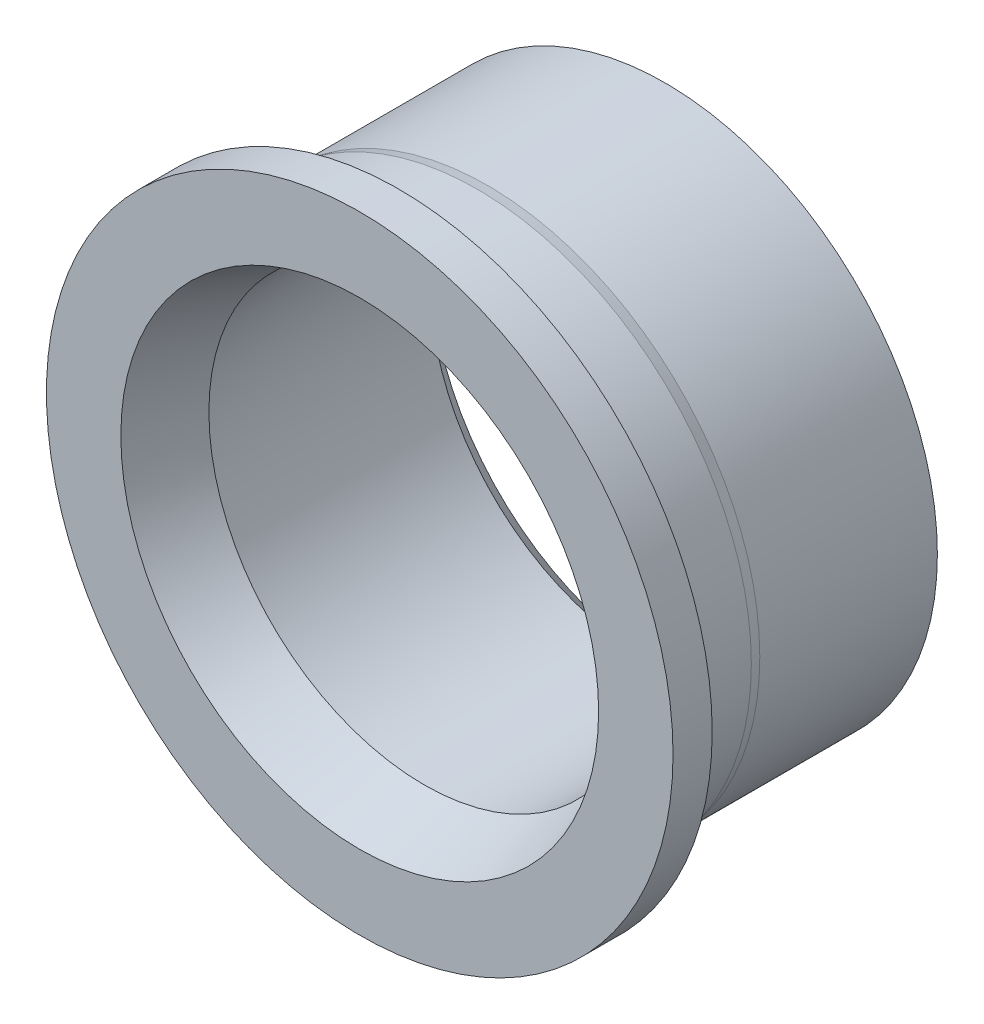
ISO-10303-21;
HEADER;
FILE_DESCRIPTION(('STEP AP214'),'2;1');
FILE_NAME('part.step','',(''),(''),'','','');
FILE_SCHEMA(('AUTOMOTIVE_DESIGN { 1 0 10303 214 1 1 1 1 }'));
ENDSEC;
DATA;
#1=APPLICATION_CONTEXT('core data for automotive mechanical design processes');
#2=APPLICATION_PROTOCOL_DEFINITION('international standard','automotive_design',2000,#1);
#3=PRODUCT_CONTEXT('',#1,'mechanical');
#4=PRODUCT('Part','Part','',(#3));
#5=PRODUCT_RELATED_PRODUCT_CATEGORY('part','',(#4));
#6=PRODUCT_DEFINITION_FORMATION('','',#4);
#7=PRODUCT_DEFINITION_CONTEXT('part definition',#1,'design');
#8=PRODUCT_DEFINITION('design','',#6,#7);
#9=PRODUCT_DEFINITION_SHAPE('','',#8);
#10=(LENGTH_UNIT() NAMED_UNIT(*) SI_UNIT(.MILLI.,.METRE.));
#11=(NAMED_UNIT(*) PLANE_ANGLE_UNIT() SI_UNIT($,.RADIAN.));
#12=(NAMED_UNIT(*) SI_UNIT($,.STERADIAN.) SOLID_ANGLE_UNIT());
#13=UNCERTAINTY_MEASURE_WITH_UNIT(LENGTH_MEASURE(1.E-05),#10,'distance_accuracy_value','');
#14=(GEOMETRIC_REPRESENTATION_CONTEXT(3) GLOBAL_UNCERTAINTY_ASSIGNED_CONTEXT((#13)) GLOBAL_UNIT_ASSIGNED_CONTEXT((#10,
#11,#12)) REPRESENTATION_CONTEXT('',''));
#15=CARTESIAN_POINT('',(0.,0.,0.));
#16=DIRECTION('',(0.,0.,1.));
#17=DIRECTION('',(1.,0.,0.));
#18=AXIS2_PLACEMENT_3D('',#15,#16,#17);
#19=CARTESIAN_POINT('',(0.,8.,0.));
#20=DIRECTION('',(0.,0.,-1.));
#21=DIRECTION('',(-1.,0.,0.));
#22=AXIS2_PLACEMENT_3D('',#19,#20,#21);
#23=PLANE('',#22);
#24=CARTESIAN_POINT('',(0.,0.,0.));
#25=DIRECTION('',(0.,0.,-1.));
#26=DIRECTION('',(-1.,0.,0.));
#27=AXIS2_PLACEMENT_3D('',#24,#25,#26);
#28=CIRCLE('',#27,6.1);
#29=CARTESIAN_POINT('',(-6.1,0.,0.));
#30=VERTEX_POINT('',#29);
#31=EDGE_CURVE('E12',#30,#30,#28,.T.);
#32=ORIENTED_EDGE('',*,*,#31,.T.);
#33=EDGE_LOOP('',(#32));
#34=FACE_BOUND('',#33,.T.);
#35=CARTESIAN_POINT('',(0.,0.,0.));
#36=DIRECTION('',(0.,0.,1.));
#37=DIRECTION('',(1.,0.,0.));
#38=AXIS2_PLACEMENT_3D('',#35,#36,#37);
#39=CIRCLE('',#38,8.);
#40=CARTESIAN_POINT('',(8.,0.,0.));
#41=VERTEX_POINT('',#40);
#42=EDGE_CURVE('E76',#41,#41,#39,.T.);
#43=ORIENTED_EDGE('',*,*,#42,.T.);
#44=EDGE_LOOP('',(#43));
#45=FACE_BOUND('',#44,.T.);
#46=ADVANCED_FACE('F41',(#34,#45),#23,.F.);
#47=CARTESIAN_POINT('',(0.,0.,0.));
#48=DIRECTION('',(0.,0.,1.));
#49=DIRECTION('',(1.,0.,0.));
#50=AXIS2_PLACEMENT_3D('',#47,#48,#49);
#51=CYLINDRICAL_SURFACE('',#50,5.5);
#52=CARTESIAN_POINT('',(0.,0.,-1.64848645167276));
#53=DIRECTION('',(0.,0.,-1.));
#54=DIRECTION('',(-1.,0.,0.));
#55=AXIS2_PLACEMENT_3D('',#52,#53,#54);
#56=CIRCLE('',#55,5.5);
#57=CARTESIAN_POINT('',(-5.5,0.,-1.64848645167276));
#58=VERTEX_POINT('',#57);
#59=EDGE_CURVE('E48',#58,#58,#56,.F.);
#60=ORIENTED_EDGE('',*,*,#59,.T.);
#61=EDGE_LOOP('',(#60));
#62=FACE_BOUND('',#61,.T.);
#63=CARTESIAN_POINT('',(0.,0.,-7.3));
#64=DIRECTION('',(0.,0.,1.));
#65=DIRECTION('',(1.,0.,0.));
#66=AXIS2_PLACEMENT_3D('',#63,#64,#65);
#67=CIRCLE('',#66,5.5);
#68=CARTESIAN_POINT('',(5.5,0.,-7.3));
#69=VERTEX_POINT('',#68);
#70=EDGE_CURVE('E52',#69,#69,#67,.F.);
#71=ORIENTED_EDGE('',*,*,#70,.T.);
#72=EDGE_LOOP('',(#71));
#73=FACE_BOUND('',#72,.T.);
#74=ADVANCED_FACE('F114',(#62,#73),#51,.F.);
#75=CARTESIAN_POINT('',(0.,5.5,-7.8));
#76=DIRECTION('',(0.,0.,1.));
#77=DIRECTION('',(1.,0.,0.));
#78=AXIS2_PLACEMENT_3D('',#75,#76,#77);
#79=PLANE('',#78);
#80=CARTESIAN_POINT('',(0.,0.,-7.8));
#81=DIRECTION('',(0.,0.,1.));
#82=DIRECTION('',(1.,0.,0.));
#83=AXIS2_PLACEMENT_3D('',#80,#81,#82);
#84=CIRCLE('',#83,6.);
#85=CARTESIAN_POINT('',(6.,0.,-7.8));
#86=VERTEX_POINT('',#85);
#87=EDGE_CURVE('E56',#86,#86,#84,.T.);
#88=ORIENTED_EDGE('',*,*,#87,.T.);
#89=EDGE_LOOP('',(#88));
#90=FACE_BOUND('',#89,.T.);
#91=CARTESIAN_POINT('',(0.,0.,-7.8));
#92=DIRECTION('',(0.,0.,1.));
#93=DIRECTION('',(1.,0.,0.));
#94=AXIS2_PLACEMENT_3D('',#91,#92,#93);
#95=CIRCLE('',#94,6.95);
#96=CARTESIAN_POINT('',(6.95,0.,-7.8));
#97=VERTEX_POINT('',#96);
#98=EDGE_CURVE('E61',#97,#97,#95,.T.);
#99=ORIENTED_EDGE('',*,*,#98,.F.);
#100=EDGE_LOOP('',(#99));
#101=FACE_BOUND('',#100,.T.);
#102=ADVANCED_FACE('F109',(#90,#101),#79,.F.);
#103=CARTESIAN_POINT('',(0.,0.,0.));
#104=DIRECTION('',(0.,0.,1.));
#105=DIRECTION('',(1.,0.,0.));
#106=AXIS2_PLACEMENT_3D('',#103,#104,#105);
#107=CYLINDRICAL_SURFACE('',#106,6.95);
#108=CARTESIAN_POINT('',(0.,0.,-3.2655745069445));
#109=DIRECTION('',(0.,0.,1.));
#110=DIRECTION('',(1.,0.,0.));
#111=AXIS2_PLACEMENT_3D('',#108,#109,#110);
#112=CIRCLE('',#111,6.95);
#113=CARTESIAN_POINT('',(6.95,0.,-3.2655745069445));
#114=VERTEX_POINT('',#113);
#115=EDGE_CURVE('E64',#114,#114,#112,.T.);
#116=ORIENTED_EDGE('',*,*,#115,.F.);
#117=EDGE_LOOP('',(#116));
#118=FACE_BOUND('',#117,.T.);
#119=ORIENTED_EDGE('',*,*,#98,.T.);
#120=EDGE_LOOP('',(#119));
#121=FACE_BOUND('',#120,.T.);
#122=ADVANCED_FACE('F103',(#118,#121),#107,.T.);
#123=CARTESIAN_POINT('',(0.,0.,-3.2655745069445));
#124=DIRECTION('',(0.,0.,1.));
#125=DIRECTION('',(1.,0.,0.));
#126=AXIS2_PLACEMENT_3D('',#123,#124,#125);
#127=CONICAL_SURFACE('',#126,6.95,0.186092740965923);
#128=CARTESIAN_POINT('',(0.,0.,-3.));
#129=DIRECTION('',(0.,0.,1.));
#130=DIRECTION('',(1.,0.,0.));
#131=AXIS2_PLACEMENT_3D('',#128,#129,#130);
#132=CIRCLE('',#131,7.);
#133=CARTESIAN_POINT('',(7.,0.,-3.));
#134=VERTEX_POINT('',#133);
#135=EDGE_CURVE('E67',#134,#134,#132,.T.);
#136=ORIENTED_EDGE('',*,*,#135,.F.);
#137=EDGE_LOOP('',(#136));
#138=FACE_BOUND('',#137,.T.);
#139=ORIENTED_EDGE('',*,*,#115,.T.);
#140=EDGE_LOOP('',(#139));
#141=FACE_BOUND('',#140,.T.);
#142=ADVANCED_FACE('F97',(#138,#141),#127,.T.);
#143=CARTESIAN_POINT('',(0.,0.,0.));
#144=DIRECTION('',(0.,0.,1.));
#145=DIRECTION('',(1.,0.,0.));
#146=AXIS2_PLACEMENT_3D('',#143,#144,#145);
#147=CYLINDRICAL_SURFACE('',#146,7.);
#148=CARTESIAN_POINT('',(0.,0.,-1.));
#149=DIRECTION('',(0.,0.,1.));
#150=DIRECTION('',(1.,0.,0.));
#151=AXIS2_PLACEMENT_3D('',#148,#149,#150);
#152=CIRCLE('',#151,7.);
#153=CARTESIAN_POINT('',(7.,0.,-1.));
#154=VERTEX_POINT('',#153);
#155=EDGE_CURVE('E70',#154,#154,#152,.T.);
#156=ORIENTED_EDGE('',*,*,#155,.F.);
#157=EDGE_LOOP('',(#156));
#158=FACE_BOUND('',#157,.T.);
#159=ORIENTED_EDGE('',*,*,#135,.T.);
#160=EDGE_LOOP('',(#159));
#161=FACE_BOUND('',#160,.T.);
#162=ADVANCED_FACE('F91',(#158,#161),#147,.T.);
#163=CARTESIAN_POINT('',(0.,7.,-1.));
#164=DIRECTION('',(0.,0.,1.));
#165=DIRECTION('',(1.,0.,0.));
#166=AXIS2_PLACEMENT_3D('',#163,#164,#165);
#167=PLANE('',#166);
#168=CARTESIAN_POINT('',(0.,0.,-1.));
#169=DIRECTION('',(0.,0.,1.));
#170=DIRECTION('',(1.,0.,0.));
#171=AXIS2_PLACEMENT_3D('',#168,#169,#170);
#172=CIRCLE('',#171,8.);
#173=CARTESIAN_POINT('',(8.,0.,-1.));
#174=VERTEX_POINT('',#173);
#175=EDGE_CURVE('E73',#174,#174,#172,.T.);
#176=ORIENTED_EDGE('',*,*,#175,.F.);
#177=EDGE_LOOP('',(#176));
#178=FACE_BOUND('',#177,.T.);
#179=ORIENTED_EDGE('',*,*,#155,.T.);
#180=EDGE_LOOP('',(#179));
#181=FACE_BOUND('',#180,.T.);
#182=ADVANCED_FACE('F85',(#178,#181),#167,.F.);
#183=CARTESIAN_POINT('',(0.,0.,0.));
#184=DIRECTION('',(0.,0.,1.));
#185=DIRECTION('',(1.,0.,0.));
#186=AXIS2_PLACEMENT_3D('',#183,#184,#185);
#187=CYLINDRICAL_SURFACE('',#186,8.);
#188=ORIENTED_EDGE('',*,*,#42,.F.);
#189=EDGE_LOOP('',(#188));
#190=FACE_BOUND('',#189,.T.);
#191=ORIENTED_EDGE('',*,*,#175,.T.);
#192=EDGE_LOOP('',(#191));
#193=FACE_BOUND('',#192,.T.);
#194=ADVANCED_FACE('F81',(#190,#193),#187,.T.);
#195=CARTESIAN_POINT('',(0.,0.,-7.8));
#196=DIRECTION('',(0.,0.,-1.));
#197=DIRECTION('',(-1.,0.,0.));
#198=AXIS2_PLACEMENT_3D('',#195,#196,#197);
#199=CONICAL_SURFACE('',#198,6.,0.785398163397446);
#200=ORIENTED_EDGE('',*,*,#70,.F.);
#201=EDGE_LOOP('',(#200));
#202=FACE_BOUND('',#201,.T.);
#203=ORIENTED_EDGE('',*,*,#87,.F.);
#204=EDGE_LOOP('',(#203));
#205=FACE_BOUND('',#204,.T.);
#206=ADVANCED_FACE('F84',(#202,#205),#199,.F.);
#207=CARTESIAN_POINT('',(0.,0.,-1.64848645167276));
#208=DIRECTION('',(0.,0.,1.));
#209=DIRECTION('',(1.,0.,0.));
#210=AXIS2_PLACEMENT_3D('',#207,#208,#209);
#211=CONICAL_SURFACE('',#210,5.5,0.349065850398866);
#212=ORIENTED_EDGE('',*,*,#31,.F.);
#213=EDGE_LOOP('',(#212));
#214=FACE_BOUND('',#213,.T.);
#215=ORIENTED_EDGE('',*,*,#59,.F.);
#216=EDGE_LOOP('',(#215));
#217=FACE_BOUND('',#216,.T.);
#218=ADVANCED_FACE('F43',(#214,#217),#211,.F.);
#219=CLOSED_SHELL('',(#46,#74,#102,#122,#142,#162,#182,#194,#206,#218));
#220=MANIFOLD_SOLID_BREP('B2',#219);
#221=ADVANCED_BREP_SHAPE_REPRESENTATION('',(#18,#220),#14);
#222=SHAPE_DEFINITION_REPRESENTATION(#9,#221);
ENDSEC;
END-ISO-10303-21;
